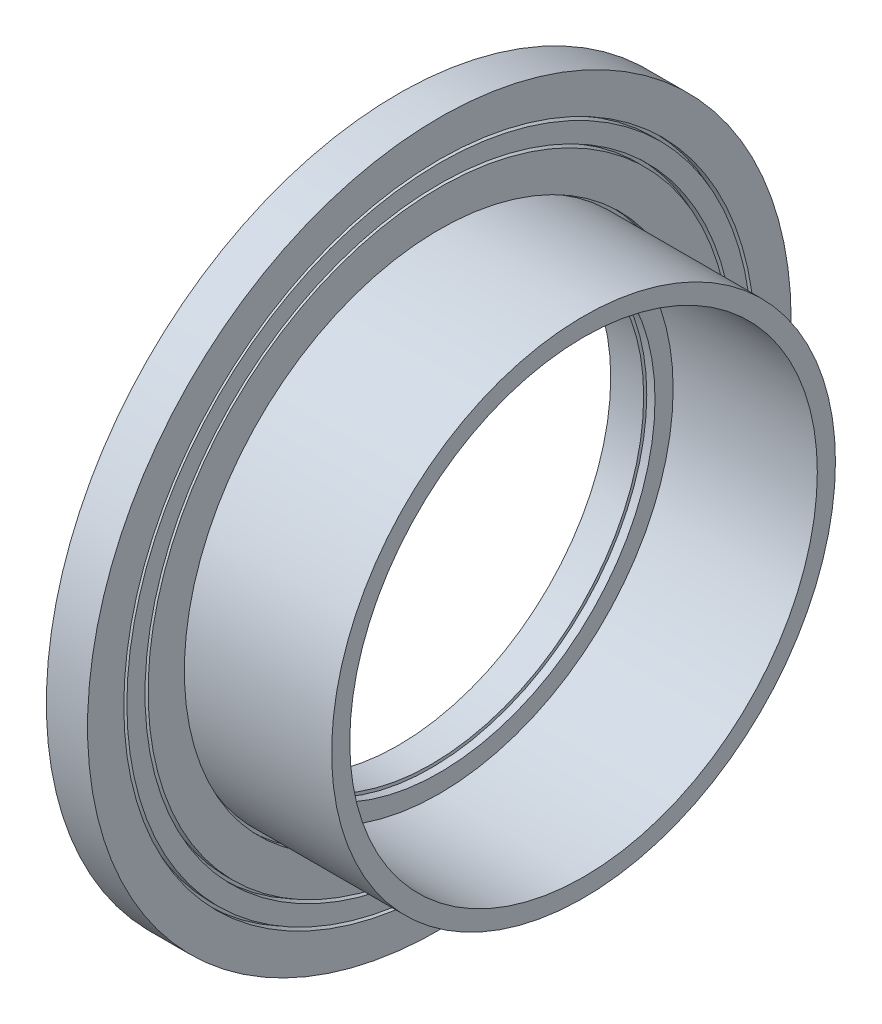
ISO-10303-21;
HEADER;
FILE_DESCRIPTION(('STEP AP214'),'2;1');
FILE_NAME('part.step','',(''),(''),'','','');
FILE_SCHEMA(('AUTOMOTIVE_DESIGN { 1 0 10303 214 1 1 1 1 }'));
ENDSEC;
DATA;
#1=APPLICATION_CONTEXT('core data for automotive mechanical design processes');
#2=APPLICATION_PROTOCOL_DEFINITION('international standard','automotive_design',2000,#1);
#3=PRODUCT_CONTEXT('',#1,'mechanical');
#4=PRODUCT('Part','Part','',(#3));
#5=PRODUCT_RELATED_PRODUCT_CATEGORY('part','',(#4));
#6=PRODUCT_DEFINITION_FORMATION('','',#4);
#7=PRODUCT_DEFINITION_CONTEXT('part definition',#1,'design');
#8=PRODUCT_DEFINITION('design','',#6,#7);
#9=PRODUCT_DEFINITION_SHAPE('','',#8);
#10=(LENGTH_UNIT() NAMED_UNIT(*) SI_UNIT(.MILLI.,.METRE.));
#11=(NAMED_UNIT(*) PLANE_ANGLE_UNIT() SI_UNIT($,.RADIAN.));
#12=(NAMED_UNIT(*) SI_UNIT($,.STERADIAN.) SOLID_ANGLE_UNIT());
#13=UNCERTAINTY_MEASURE_WITH_UNIT(LENGTH_MEASURE(1.E-05),#10,'distance_accuracy_value','');
#14=(GEOMETRIC_REPRESENTATION_CONTEXT(3) GLOBAL_UNCERTAINTY_ASSIGNED_CONTEXT((#13)) GLOBAL_UNIT_ASSIGNED_CONTEXT((#10,
#11,#12)) REPRESENTATION_CONTEXT('',''));
#15=CARTESIAN_POINT('',(0.,0.,0.));
#16=DIRECTION('',(0.,0.,1.));
#17=DIRECTION('',(1.,0.,0.));
#18=AXIS2_PLACEMENT_3D('',#15,#16,#17);
#19=CARTESIAN_POINT('',(2.,0.,0.));
#20=DIRECTION('',(1.,0.,0.));
#21=DIRECTION('',(0.,0.,-1.));
#22=AXIS2_PLACEMENT_3D('',#19,#20,#21);
#23=PLANE('',#22);
#24=CARTESIAN_POINT('',(2.,0.,0.));
#25=DIRECTION('',(1.,0.,0.));
#26=DIRECTION('',(0.,0.,-1.));
#27=AXIS2_PLACEMENT_3D('',#24,#25,#26);
#28=CIRCLE('',#27,14.29);
#29=CARTESIAN_POINT('',(2.,0.,-14.29));
#30=VERTEX_POINT('',#29);
#31=EDGE_CURVE('E77',#30,#30,#28,.T.);
#32=ORIENTED_EDGE('',*,*,#31,.F.);
#33=EDGE_LOOP('',(#32));
#34=FACE_BOUND('',#33,.T.);
#35=CARTESIAN_POINT('',(2.,0.,0.));
#36=DIRECTION('',(1.,0.,0.));
#37=DIRECTION('',(0.,0.,-1.));
#38=AXIS2_PLACEMENT_3D('',#35,#36,#37);
#39=CIRCLE('',#38,15.17);
#40=CARTESIAN_POINT('',(2.,0.,-15.17));
#41=VERTEX_POINT('',#40);
#42=EDGE_CURVE('E95',#41,#41,#39,.T.);
#43=ORIENTED_EDGE('',*,*,#42,.T.);
#44=EDGE_LOOP('',(#43));
#45=FACE_BOUND('',#44,.T.);
#46=ADVANCED_FACE('F32',(#34,#45),#23,.T.);
#47=CARTESIAN_POINT('',(2.,0.,0.));
#48=DIRECTION('',(1.,0.,0.));
#49=DIRECTION('',(0.,0.,-1.));
#50=AXIS2_PLACEMENT_3D('',#47,#48,#49);
#51=CIRCLE('',#50,12.38);
#52=CARTESIAN_POINT('',(2.,0.,-12.38));
#53=VERTEX_POINT('',#52);
#54=EDGE_CURVE('E68',#53,#53,#51,.T.);
#55=ORIENTED_EDGE('',*,*,#54,.F.);
#56=EDGE_LOOP('',(#55));
#57=FACE_BOUND('',#56,.T.);
#58=CARTESIAN_POINT('',(2.,0.,0.));
#59=DIRECTION('',(1.,0.,0.));
#60=DIRECTION('',(0.,0.,-1.));
#61=AXIS2_PLACEMENT_3D('',#58,#59,#60);
#62=CIRCLE('',#61,14.14);
#63=CARTESIAN_POINT('',(2.,0.,-14.14));
#64=VERTEX_POINT('',#63);
#65=EDGE_CURVE('E83',#64,#64,#62,.T.);
#66=ORIENTED_EDGE('',*,*,#65,.T.);
#67=EDGE_LOOP('',(#66));
#68=FACE_BOUND('',#67,.T.);
#69=ADVANCED_FACE('F122',(#57,#68),#23,.T.);
#70=CARTESIAN_POINT('',(2.,0.,0.));
#71=DIRECTION('',(-1.,0.,0.));
#72=DIRECTION('',(0.,0.,1.));
#73=AXIS2_PLACEMENT_3D('',#70,#71,#72);
#74=CYLINDRICAL_SURFACE('',#73,10.32);
#75=CARTESIAN_POINT('',(0.,0.,0.));
#76=DIRECTION('',(1.,0.,0.));
#77=DIRECTION('',(0.,0.,-1.));
#78=AXIS2_PLACEMENT_3D('',#75,#76,#77);
#79=CIRCLE('',#78,10.32);
#80=CARTESIAN_POINT('',(0.,0.,-10.32));
#81=VERTEX_POINT('',#80);
#82=EDGE_CURVE('E48',#81,#81,#79,.T.);
#83=ORIENTED_EDGE('',*,*,#82,.F.);
#84=EDGE_LOOP('',(#83));
#85=FACE_BOUND('',#84,.T.);
#86=CARTESIAN_POINT('',(1.6,0.,0.));
#87=DIRECTION('',(1.,0.,0.));
#88=DIRECTION('',(0.,0.,-1.));
#89=AXIS2_PLACEMENT_3D('',#86,#87,#88);
#90=CIRCLE('',#89,10.32);
#91=CARTESIAN_POINT('',(1.6,0.,-10.32));
#92=VERTEX_POINT('',#91);
#93=EDGE_CURVE('E62',#92,#92,#90,.T.);
#94=ORIENTED_EDGE('',*,*,#93,.T.);
#95=EDGE_LOOP('',(#94));
#96=FACE_BOUND('',#95,.T.);
#97=ADVANCED_FACE('F120',(#85,#96),#74,.F.);
#98=CARTESIAN_POINT('',(2.,0.,0.));
#99=DIRECTION('',(1.,0.,0.));
#100=DIRECTION('',(0.,0.,-1.));
#101=AXIS2_PLACEMENT_3D('',#98,#99,#100);
#102=CIRCLE('',#101,15.32);
#103=CARTESIAN_POINT('',(2.,0.,-15.32));
#104=VERTEX_POINT('',#103);
#105=EDGE_CURVE('E89',#104,#104,#102,.T.);
#106=ORIENTED_EDGE('',*,*,#105,.F.);
#107=EDGE_LOOP('',(#106));
#108=FACE_BOUND('',#107,.T.);
#109=CARTESIAN_POINT('',(2.,0.,0.));
#110=DIRECTION('',(1.,0.,0.));
#111=DIRECTION('',(0.,0.,-1.));
#112=AXIS2_PLACEMENT_3D('',#109,#110,#111);
#113=CIRCLE('',#112,17.08);
#114=CARTESIAN_POINT('',(2.,0.,-17.08));
#115=VERTEX_POINT('',#114);
#116=EDGE_CURVE('E39',#115,#115,#113,.T.);
#117=ORIENTED_EDGE('',*,*,#116,.T.);
#118=EDGE_LOOP('',(#117));
#119=FACE_BOUND('',#118,.T.);
#120=ADVANCED_FACE('F117',(#108,#119),#23,.T.);
#121=CARTESIAN_POINT('',(2.,0.,0.));
#122=DIRECTION('',(1.,0.,0.));
#123=DIRECTION('',(0.,0.,-1.));
#124=AXIS2_PLACEMENT_3D('',#121,#122,#123);
#125=CIRCLE('',#124,10.47);
#126=CARTESIAN_POINT('',(2.,0.,-10.47));
#127=VERTEX_POINT('',#126);
#128=EDGE_CURVE('E59',#127,#127,#125,.T.);
#129=ORIENTED_EDGE('',*,*,#128,.F.);
#130=EDGE_LOOP('',(#129));
#131=FACE_BOUND('',#130,.T.);
#132=CARTESIAN_POINT('',(2.,0.,0.));
#133=DIRECTION('',(1.,0.,0.));
#134=DIRECTION('',(0.,0.,-1.));
#135=AXIS2_PLACEMENT_3D('',#132,#133,#134);
#136=CIRCLE('',#135,11.35);
#137=CARTESIAN_POINT('',(2.,0.,-11.35));
#138=VERTEX_POINT('',#137);
#139=EDGE_CURVE('E10',#138,#138,#136,.F.);
#140=ORIENTED_EDGE('',*,*,#139,.F.);
#141=EDGE_LOOP('',(#140));
#142=FACE_BOUND('',#141,.T.);
#143=ADVANCED_FACE('F119',(#131,#142),#23,.T.);
#144=CARTESIAN_POINT('',(0.,0.,0.));
#145=DIRECTION('',(1.,0.,0.));
#146=DIRECTION('',(0.,0.,-1.));
#147=AXIS2_PLACEMENT_3D('',#144,#145,#146);
#148=PLANE('',#147);
#149=CARTESIAN_POINT('',(0.,0.,0.));
#150=DIRECTION('',(1.,0.,0.));
#151=DIRECTION('',(0.,0.,-1.));
#152=AXIS2_PLACEMENT_3D('',#149,#150,#151);
#153=CIRCLE('',#152,17.08);
#154=CARTESIAN_POINT('',(0.,0.,-17.08));
#155=VERTEX_POINT('',#154);
#156=EDGE_CURVE('E43',#155,#155,#153,.T.);
#157=ORIENTED_EDGE('',*,*,#156,.F.);
#158=EDGE_LOOP('',(#157));
#159=FACE_BOUND('',#158,.T.);
#160=ORIENTED_EDGE('',*,*,#82,.T.);
#161=EDGE_LOOP('',(#160));
#162=FACE_BOUND('',#161,.T.);
#163=ADVANCED_FACE('F127',(#159,#162),#148,.F.);
#164=CARTESIAN_POINT('',(2.,0.,0.));
#165=DIRECTION('',(-1.,0.,0.));
#166=DIRECTION('',(0.,0.,1.));
#167=AXIS2_PLACEMENT_3D('',#164,#165,#166);
#168=CYLINDRICAL_SURFACE('',#167,17.08);
#169=ORIENTED_EDGE('',*,*,#116,.F.);
#170=EDGE_LOOP('',(#169));
#171=FACE_BOUND('',#170,.T.);
#172=ORIENTED_EDGE('',*,*,#156,.T.);
#173=EDGE_LOOP('',(#172));
#174=FACE_BOUND('',#173,.T.);
#175=ADVANCED_FACE('F34',(#171,#174),#168,.T.);
#176=CARTESIAN_POINT('',(9.,0.,0.));
#177=DIRECTION('',(1.,0.,0.));
#178=DIRECTION('',(0.,0.,-1.));
#179=AXIS2_PLACEMENT_3D('',#176,#177,#178);
#180=PLANE('',#179);
#181=CARTESIAN_POINT('',(9.,0.,0.));
#182=DIRECTION('',(1.,0.,0.));
#183=DIRECTION('',(0.,0.,-1.));
#184=AXIS2_PLACEMENT_3D('',#181,#182,#183);
#185=CIRCLE('',#184,12.23);
#186=CARTESIAN_POINT('',(9.,0.,-12.23));
#187=VERTEX_POINT('',#186);
#188=EDGE_CURVE('E52',#187,#187,#185,.T.);
#189=ORIENTED_EDGE('',*,*,#188,.T.);
#190=EDGE_LOOP('',(#189));
#191=FACE_BOUND('',#190,.T.);
#192=CARTESIAN_POINT('',(9.,0.,0.));
#193=DIRECTION('',(1.,0.,0.));
#194=DIRECTION('',(0.,0.,-1.));
#195=AXIS2_PLACEMENT_3D('',#192,#193,#194);
#196=CIRCLE('',#195,11.35);
#197=CARTESIAN_POINT('',(9.,0.,-11.35));
#198=VERTEX_POINT('',#197);
#199=EDGE_CURVE('E55',#198,#198,#196,.T.);
#200=ORIENTED_EDGE('',*,*,#199,.F.);
#201=EDGE_LOOP('',(#200));
#202=FACE_BOUND('',#201,.T.);
#203=ADVANCED_FACE('F177',(#191,#202),#180,.T.);
#204=CARTESIAN_POINT('',(9.,0.,0.));
#205=DIRECTION('',(-1.,0.,0.));
#206=DIRECTION('',(0.,0.,1.));
#207=AXIS2_PLACEMENT_3D('',#204,#205,#206);
#208=CYLINDRICAL_SURFACE('',#207,12.23);
#209=ORIENTED_EDGE('',*,*,#188,.F.);
#210=EDGE_LOOP('',(#209));
#211=FACE_BOUND('',#210,.T.);
#212=CARTESIAN_POINT('',(1.6,0.,0.));
#213=DIRECTION('',(1.,0.,0.));
#214=DIRECTION('',(0.,0.,-1.));
#215=AXIS2_PLACEMENT_3D('',#212,#213,#214);
#216=CIRCLE('',#215,12.23);
#217=CARTESIAN_POINT('',(1.6,0.,-12.23));
#218=VERTEX_POINT('',#217);
#219=EDGE_CURVE('E71',#218,#218,#216,.T.);
#220=ORIENTED_EDGE('',*,*,#219,.T.);
#221=EDGE_LOOP('',(#220));
#222=FACE_BOUND('',#221,.T.);
#223=ADVANCED_FACE('F175',(#211,#222),#208,.T.);
#224=CARTESIAN_POINT('',(9.,0.,0.));
#225=DIRECTION('',(-1.,0.,0.));
#226=DIRECTION('',(0.,0.,1.));
#227=AXIS2_PLACEMENT_3D('',#224,#225,#226);
#228=CYLINDRICAL_SURFACE('',#227,11.35);
#229=ORIENTED_EDGE('',*,*,#199,.T.);
#230=EDGE_LOOP('',(#229));
#231=FACE_BOUND('',#230,.T.);
#232=ORIENTED_EDGE('',*,*,#139,.T.);
#233=EDGE_LOOP('',(#232));
#234=FACE_BOUND('',#233,.T.);
#235=ADVANCED_FACE('F171',(#231,#234),#228,.F.);
#236=CARTESIAN_POINT('',(1.6,0.,0.));
#237=DIRECTION('',(1.,0.,0.));
#238=DIRECTION('',(0.,0.,-1.));
#239=AXIS2_PLACEMENT_3D('',#236,#237,#238);
#240=CYLINDRICAL_SURFACE('',#239,10.47);
#241=CARTESIAN_POINT('',(1.6,0.,0.));
#242=DIRECTION('',(1.,0.,0.));
#243=DIRECTION('',(0.,0.,-1.));
#244=AXIS2_PLACEMENT_3D('',#241,#242,#243);
#245=CIRCLE('',#244,10.47);
#246=CARTESIAN_POINT('',(1.6,0.,-10.47));
#247=VERTEX_POINT('',#246);
#248=EDGE_CURVE('E58',#247,#247,#245,.T.);
#249=ORIENTED_EDGE('',*,*,#248,.F.);
#250=EDGE_LOOP('',(#249));
#251=FACE_BOUND('',#250,.T.);
#252=ORIENTED_EDGE('',*,*,#128,.T.);
#253=EDGE_LOOP('',(#252));
#254=FACE_BOUND('',#253,.T.);
#255=ADVANCED_FACE('F167',(#251,#254),#240,.F.);
#256=CARTESIAN_POINT('',(1.6,0.,0.));
#257=DIRECTION('',(1.,0.,0.));
#258=DIRECTION('',(0.,0.,-1.));
#259=AXIS2_PLACEMENT_3D('',#256,#257,#258);
#260=PLANE('',#259);
#261=ORIENTED_EDGE('',*,*,#93,.F.);
#262=EDGE_LOOP('',(#261));
#263=FACE_BOUND('',#262,.T.);
#264=ORIENTED_EDGE('',*,*,#248,.T.);
#265=EDGE_LOOP('',(#264));
#266=FACE_BOUND('',#265,.T.);
#267=ADVANCED_FACE('F163',(#263,#266),#260,.T.);
#268=CARTESIAN_POINT('',(1.6,0.,0.));
#269=DIRECTION('',(1.,0.,0.));
#270=DIRECTION('',(0.,0.,-1.));
#271=AXIS2_PLACEMENT_3D('',#268,#269,#270);
#272=CYLINDRICAL_SURFACE('',#271,12.38);
#273=CARTESIAN_POINT('',(1.6,0.,0.));
#274=DIRECTION('',(1.,0.,0.));
#275=DIRECTION('',(0.,0.,-1.));
#276=AXIS2_PLACEMENT_3D('',#273,#274,#275);
#277=CIRCLE('',#276,12.38);
#278=CARTESIAN_POINT('',(1.6,0.,-12.38));
#279=VERTEX_POINT('',#278);
#280=EDGE_CURVE('E67',#279,#279,#277,.T.);
#281=ORIENTED_EDGE('',*,*,#280,.F.);
#282=EDGE_LOOP('',(#281));
#283=FACE_BOUND('',#282,.T.);
#284=ORIENTED_EDGE('',*,*,#54,.T.);
#285=EDGE_LOOP('',(#284));
#286=FACE_BOUND('',#285,.T.);
#287=ADVANCED_FACE('F159',(#283,#286),#272,.F.);
#288=CARTESIAN_POINT('',(1.6,0.,0.));
#289=DIRECTION('',(1.,0.,0.));
#290=DIRECTION('',(0.,0.,-1.));
#291=AXIS2_PLACEMENT_3D('',#288,#289,#290);
#292=PLANE('',#291);
#293=ORIENTED_EDGE('',*,*,#219,.F.);
#294=EDGE_LOOP('',(#293));
#295=FACE_BOUND('',#294,.T.);
#296=ORIENTED_EDGE('',*,*,#280,.T.);
#297=EDGE_LOOP('',(#296));
#298=FACE_BOUND('',#297,.T.);
#299=ADVANCED_FACE('F155',(#295,#298),#292,.T.);
#300=CARTESIAN_POINT('',(1.6,0.,0.));
#301=DIRECTION('',(1.,0.,0.));
#302=DIRECTION('',(0.,0.,-1.));
#303=AXIS2_PLACEMENT_3D('',#300,#301,#302);
#304=CYLINDRICAL_SURFACE('',#303,14.29);
#305=CARTESIAN_POINT('',(1.6,0.,0.));
#306=DIRECTION('',(1.,0.,0.));
#307=DIRECTION('',(0.,0.,-1.));
#308=AXIS2_PLACEMENT_3D('',#305,#306,#307);
#309=CIRCLE('',#308,14.29);
#310=CARTESIAN_POINT('',(1.6,0.,-14.29));
#311=VERTEX_POINT('',#310);
#312=EDGE_CURVE('E76',#311,#311,#309,.T.);
#313=ORIENTED_EDGE('',*,*,#312,.F.);
#314=EDGE_LOOP('',(#313));
#315=FACE_BOUND('',#314,.T.);
#316=ORIENTED_EDGE('',*,*,#31,.T.);
#317=EDGE_LOOP('',(#316));
#318=FACE_BOUND('',#317,.T.);
#319=ADVANCED_FACE('F151',(#315,#318),#304,.F.);
#320=CARTESIAN_POINT('',(1.6,0.,0.));
#321=DIRECTION('',(1.,0.,0.));
#322=DIRECTION('',(0.,0.,-1.));
#323=AXIS2_PLACEMENT_3D('',#320,#321,#322);
#324=PLANE('',#323);
#325=CARTESIAN_POINT('',(1.6,0.,0.));
#326=DIRECTION('',(1.,0.,0.));
#327=DIRECTION('',(0.,0.,-1.));
#328=AXIS2_PLACEMENT_3D('',#325,#326,#327);
#329=CIRCLE('',#328,14.14);
#330=CARTESIAN_POINT('',(1.6,0.,-14.14));
#331=VERTEX_POINT('',#330);
#332=EDGE_CURVE('E80',#331,#331,#329,.T.);
#333=ORIENTED_EDGE('',*,*,#332,.F.);
#334=EDGE_LOOP('',(#333));
#335=FACE_BOUND('',#334,.T.);
#336=ORIENTED_EDGE('',*,*,#312,.T.);
#337=EDGE_LOOP('',(#336));
#338=FACE_BOUND('',#337,.T.);
#339=ADVANCED_FACE('F147',(#335,#338),#324,.T.);
#340=CARTESIAN_POINT('',(1.6,0.,0.));
#341=DIRECTION('',(1.,0.,0.));
#342=DIRECTION('',(0.,0.,-1.));
#343=AXIS2_PLACEMENT_3D('',#340,#341,#342);
#344=CYLINDRICAL_SURFACE('',#343,14.14);
#345=ORIENTED_EDGE('',*,*,#332,.T.);
#346=EDGE_LOOP('',(#345));
#347=FACE_BOUND('',#346,.T.);
#348=ORIENTED_EDGE('',*,*,#65,.F.);
#349=EDGE_LOOP('',(#348));
#350=FACE_BOUND('',#349,.T.);
#351=ADVANCED_FACE('F113',(#347,#350),#344,.T.);
#352=CARTESIAN_POINT('',(1.6,0.,0.));
#353=DIRECTION('',(1.,0.,0.));
#354=DIRECTION('',(0.,0.,-1.));
#355=AXIS2_PLACEMENT_3D('',#352,#353,#354);
#356=CYLINDRICAL_SURFACE('',#355,15.32);
#357=CARTESIAN_POINT('',(1.6,0.,0.));
#358=DIRECTION('',(1.,0.,0.));
#359=DIRECTION('',(0.,0.,-1.));
#360=AXIS2_PLACEMENT_3D('',#357,#358,#359);
#361=CIRCLE('',#360,15.32);
#362=CARTESIAN_POINT('',(1.6,0.,-15.32));
#363=VERTEX_POINT('',#362);
#364=EDGE_CURVE('E86',#363,#363,#361,.T.);
#365=ORIENTED_EDGE('',*,*,#364,.F.);
#366=EDGE_LOOP('',(#365));
#367=FACE_BOUND('',#366,.T.);
#368=ORIENTED_EDGE('',*,*,#105,.T.);
#369=EDGE_LOOP('',(#368));
#370=FACE_BOUND('',#369,.T.);
#371=ADVANCED_FACE('F107',(#367,#370),#356,.F.);
#372=CARTESIAN_POINT('',(1.6,0.,0.));
#373=DIRECTION('',(1.,0.,0.));
#374=DIRECTION('',(0.,0.,-1.));
#375=AXIS2_PLACEMENT_3D('',#372,#373,#374);
#376=PLANE('',#375);
#377=CARTESIAN_POINT('',(1.6,0.,0.));
#378=DIRECTION('',(1.,0.,0.));
#379=DIRECTION('',(0.,0.,-1.));
#380=AXIS2_PLACEMENT_3D('',#377,#378,#379);
#381=CIRCLE('',#380,15.17);
#382=CARTESIAN_POINT('',(1.6,0.,-15.17));
#383=VERTEX_POINT('',#382);
#384=EDGE_CURVE('E92',#383,#383,#381,.T.);
#385=ORIENTED_EDGE('',*,*,#384,.F.);
#386=EDGE_LOOP('',(#385));
#387=FACE_BOUND('',#386,.T.);
#388=ORIENTED_EDGE('',*,*,#364,.T.);
#389=EDGE_LOOP('',(#388));
#390=FACE_BOUND('',#389,.T.);
#391=ADVANCED_FACE('F104',(#387,#390),#376,.T.);
#392=CARTESIAN_POINT('',(1.6,0.,0.));
#393=DIRECTION('',(1.,0.,0.));
#394=DIRECTION('',(0.,0.,-1.));
#395=AXIS2_PLACEMENT_3D('',#392,#393,#394);
#396=CYLINDRICAL_SURFACE('',#395,15.17);
#397=ORIENTED_EDGE('',*,*,#384,.T.);
#398=EDGE_LOOP('',(#397));
#399=FACE_BOUND('',#398,.T.);
#400=ORIENTED_EDGE('',*,*,#42,.F.);
#401=EDGE_LOOP('',(#400));
#402=FACE_BOUND('',#401,.T.);
#403=ADVANCED_FACE('F101',(#399,#402),#396,.T.);
#404=CLOSED_SHELL('',(#46,#69,#97,#120,#143,#163,#175,#203,#223,#235,#255,#267,#287,#299,#319,
#339,#351,#371,#391,#403));
#405=MANIFOLD_SOLID_BREP('B2',#404);
#406=ADVANCED_BREP_SHAPE_REPRESENTATION('',(#18,#405),#14);
#407=SHAPE_DEFINITION_REPRESENTATION(#9,#406);
ENDSEC;
END-ISO-10303-21;
